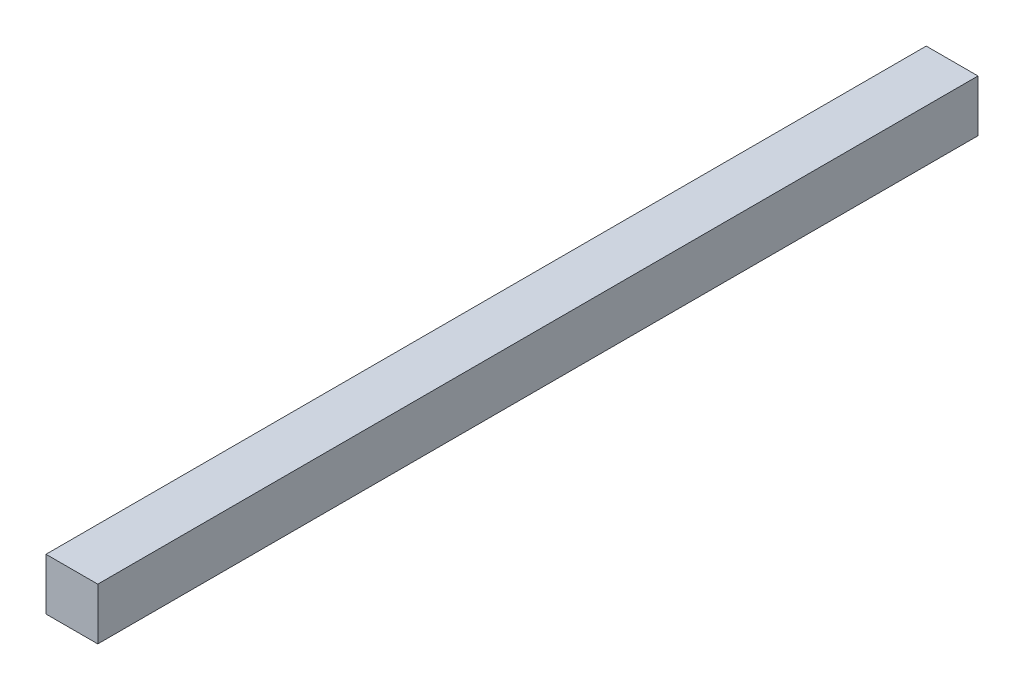
ISO-10303-21;
HEADER;
FILE_DESCRIPTION(('STEP AP214'),'2;1');
FILE_NAME('part.step','',(''),(''),'','','');
FILE_SCHEMA(('AUTOMOTIVE_DESIGN { 1 0 10303 214 1 1 1 1 }'));
ENDSEC;
DATA;
#1=APPLICATION_CONTEXT('core data for automotive mechanical design processes');
#2=APPLICATION_PROTOCOL_DEFINITION('international standard','automotive_design',2000,#1);
#3=PRODUCT_CONTEXT('',#1,'mechanical');
#4=PRODUCT('Part','Part','',(#3));
#5=PRODUCT_RELATED_PRODUCT_CATEGORY('part','',(#4));
#6=PRODUCT_DEFINITION_FORMATION('','',#4);
#7=PRODUCT_DEFINITION_CONTEXT('part definition',#1,'design');
#8=PRODUCT_DEFINITION('design','',#6,#7);
#9=PRODUCT_DEFINITION_SHAPE('','',#8);
#10=(LENGTH_UNIT() NAMED_UNIT(*) SI_UNIT(.MILLI.,.METRE.));
#11=(NAMED_UNIT(*) PLANE_ANGLE_UNIT() SI_UNIT($,.RADIAN.));
#12=(NAMED_UNIT(*) SI_UNIT($,.STERADIAN.) SOLID_ANGLE_UNIT());
#13=UNCERTAINTY_MEASURE_WITH_UNIT(LENGTH_MEASURE(1.E-05),#10,'distance_accuracy_value','');
#14=(GEOMETRIC_REPRESENTATION_CONTEXT(3) GLOBAL_UNCERTAINTY_ASSIGNED_CONTEXT((#13)) GLOBAL_UNIT_ASSIGNED_CONTEXT((#10,
#11,#12)) REPRESENTATION_CONTEXT('',''));
#15=CARTESIAN_POINT('',(0.,0.,0.));
#16=DIRECTION('',(0.,0.,1.));
#17=DIRECTION('',(1.,0.,0.));
#18=AXIS2_PLACEMENT_3D('',#15,#16,#17);
#19=CARTESIAN_POINT('',(0.,0.,431.8));
#20=DIRECTION('',(1.,0.,0.));
#21=DIRECTION('',(0.,0.,-1.));
#22=AXIS2_PLACEMENT_3D('',#19,#20,#21);
#23=PLANE('',#22);
#24=DIRECTION('',(0.,-1.,0.));
#25=VECTOR('',#24,1.);
#26=CARTESIAN_POINT('',(0.,0.,0.));
#27=LINE('',#26,#25);
#28=CARTESIAN_POINT('',(0.,25.4,0.));
#29=VERTEX_POINT('',#28);
#30=CARTESIAN_POINT('',(0.,0.,0.));
#31=VERTEX_POINT('',#30);
#32=EDGE_CURVE('E98',#29,#31,#27,.T.);
#33=ORIENTED_EDGE('',*,*,#32,.T.);
#34=DIRECTION('',(0.,0.,-1.));
#35=VECTOR('',#34,1.);
#36=CARTESIAN_POINT('',(0.,0.,431.8));
#37=LINE('',#36,#35);
#38=CARTESIAN_POINT('',(0.,0.,431.8));
#39=VERTEX_POINT('',#38);
#40=EDGE_CURVE('E11',#39,#31,#37,.T.);
#41=ORIENTED_EDGE('',*,*,#40,.F.);
#42=DIRECTION('',(0.,-1.,0.));
#43=VECTOR('',#42,1.);
#44=CARTESIAN_POINT('',(0.,0.,431.8));
#45=LINE('',#44,#43);
#46=CARTESIAN_POINT('',(0.,25.4,431.8));
#47=VERTEX_POINT('',#46);
#48=EDGE_CURVE('E86',#47,#39,#45,.T.);
#49=ORIENTED_EDGE('',*,*,#48,.F.);
#50=DIRECTION('',(0.,0.,-1.));
#51=VECTOR('',#50,1.);
#52=CARTESIAN_POINT('',(0.,25.4,431.8));
#53=LINE('',#52,#51);
#54=EDGE_CURVE('E94',#47,#29,#53,.T.);
#55=ORIENTED_EDGE('',*,*,#54,.T.);
#56=EDGE_LOOP('',(#33,#41,#49,#55));
#57=FACE_BOUND('',#56,.T.);
#58=ADVANCED_FACE('F35',(#57),#23,.F.);
#59=CARTESIAN_POINT('',(0.,0.,431.8));
#60=DIRECTION('',(0.,1.,0.));
#61=DIRECTION('',(0.,0.,1.));
#62=AXIS2_PLACEMENT_3D('',#59,#60,#61);
#63=PLANE('',#62);
#64=DIRECTION('',(1.,0.,0.));
#65=VECTOR('',#64,1.);
#66=CARTESIAN_POINT('',(0.,0.,0.));
#67=LINE('',#66,#65);
#68=CARTESIAN_POINT('',(25.4,0.,0.));
#69=VERTEX_POINT('',#68);
#70=EDGE_CURVE('E90',#31,#69,#67,.T.);
#71=ORIENTED_EDGE('',*,*,#70,.T.);
#72=DIRECTION('',(0.,0.,-1.));
#73=VECTOR('',#72,1.);
#74=CARTESIAN_POINT('',(25.4,0.,431.8));
#75=LINE('',#74,#73);
#76=CARTESIAN_POINT('',(25.4,0.,431.8));
#77=VERTEX_POINT('',#76);
#78=EDGE_CURVE('E43',#77,#69,#75,.T.);
#79=ORIENTED_EDGE('',*,*,#78,.F.);
#80=DIRECTION('',(1.,0.,0.));
#81=VECTOR('',#80,1.);
#82=CARTESIAN_POINT('',(0.,0.,431.8));
#83=LINE('',#82,#81);
#84=EDGE_CURVE('E81',#39,#77,#83,.T.);
#85=ORIENTED_EDGE('',*,*,#84,.F.);
#86=ORIENTED_EDGE('',*,*,#40,.T.);
#87=EDGE_LOOP('',(#71,#79,#85,#86));
#88=FACE_BOUND('',#87,.T.);
#89=ADVANCED_FACE('F89',(#88),#63,.F.);
#90=CARTESIAN_POINT('',(25.4,0.,431.8));
#91=DIRECTION('',(-1.,0.,0.));
#92=DIRECTION('',(0.,0.,1.));
#93=AXIS2_PLACEMENT_3D('',#90,#91,#92);
#94=PLANE('',#93);
#95=DIRECTION('',(0.,1.,0.));
#96=VECTOR('',#95,1.);
#97=CARTESIAN_POINT('',(25.4,0.,0.));
#98=LINE('',#97,#96);
#99=CARTESIAN_POINT('',(25.4,25.4,0.));
#100=VERTEX_POINT('',#99);
#101=EDGE_CURVE('E68',#69,#100,#98,.T.);
#102=ORIENTED_EDGE('',*,*,#101,.T.);
#103=DIRECTION('',(0.,0.,-1.));
#104=VECTOR('',#103,1.);
#105=CARTESIAN_POINT('',(25.4,25.4,431.8));
#106=LINE('',#105,#104);
#107=CARTESIAN_POINT('',(25.4,25.4,431.8));
#108=VERTEX_POINT('',#107);
#109=EDGE_CURVE('E91',#108,#100,#106,.T.);
#110=ORIENTED_EDGE('',*,*,#109,.F.);
#111=DIRECTION('',(0.,1.,0.));
#112=VECTOR('',#111,1.);
#113=CARTESIAN_POINT('',(25.4,0.,431.8));
#114=LINE('',#113,#112);
#115=EDGE_CURVE('E84',#77,#108,#114,.T.);
#116=ORIENTED_EDGE('',*,*,#115,.F.);
#117=ORIENTED_EDGE('',*,*,#78,.T.);
#118=EDGE_LOOP('',(#102,#110,#116,#117));
#119=FACE_BOUND('',#118,.T.);
#120=ADVANCED_FACE('F92',(#119),#94,.F.);
#121=CARTESIAN_POINT('',(0.,25.4,431.8));
#122=DIRECTION('',(0.,-1.,0.));
#123=DIRECTION('',(0.,0.,-1.));
#124=AXIS2_PLACEMENT_3D('',#121,#122,#123);
#125=PLANE('',#124);
#126=DIRECTION('',(-1.,0.,0.));
#127=VECTOR('',#126,1.);
#128=CARTESIAN_POINT('',(0.,25.4,0.));
#129=LINE('',#128,#127);
#130=EDGE_CURVE('E74',#100,#29,#129,.T.);
#131=ORIENTED_EDGE('',*,*,#130,.T.);
#132=ORIENTED_EDGE('',*,*,#54,.F.);
#133=DIRECTION('',(-1.,0.,0.));
#134=VECTOR('',#133,1.);
#135=CARTESIAN_POINT('',(0.,25.4,431.8));
#136=LINE('',#135,#134);
#137=EDGE_CURVE('E51',#108,#47,#136,.T.);
#138=ORIENTED_EDGE('',*,*,#137,.F.);
#139=ORIENTED_EDGE('',*,*,#109,.T.);
#140=EDGE_LOOP('',(#131,#132,#138,#139));
#141=FACE_BOUND('',#140,.T.);
#142=ADVANCED_FACE('F105',(#141),#125,.F.);
#143=CARTESIAN_POINT('',(0.,0.,431.8));
#144=DIRECTION('',(0.,0.,-1.));
#145=DIRECTION('',(-1.,0.,0.));
#146=AXIS2_PLACEMENT_3D('',#143,#144,#145);
#147=PLANE('',#146);
#148=ORIENTED_EDGE('',*,*,#48,.T.);
#149=ORIENTED_EDGE('',*,*,#84,.T.);
#150=ORIENTED_EDGE('',*,*,#115,.T.);
#151=ORIENTED_EDGE('',*,*,#137,.T.);
#152=EDGE_LOOP('',(#148,#149,#150,#151));
#153=FACE_BOUND('',#152,.T.);
#154=ADVANCED_FACE('F82',(#153),#147,.F.);
#155=CARTESIAN_POINT('',(0.,0.,0.));
#156=DIRECTION('',(0.,0.,-1.));
#157=DIRECTION('',(-1.,0.,0.));
#158=AXIS2_PLACEMENT_3D('',#155,#156,#157);
#159=PLANE('',#158);
#160=ORIENTED_EDGE('',*,*,#32,.F.);
#161=ORIENTED_EDGE('',*,*,#130,.F.);
#162=ORIENTED_EDGE('',*,*,#101,.F.);
#163=ORIENTED_EDGE('',*,*,#70,.F.);
#164=EDGE_LOOP('',(#160,#161,#162,#163));
#165=FACE_BOUND('',#164,.T.);
#166=ADVANCED_FACE('F108',(#165),#159,.T.);
#167=CLOSED_SHELL('',(#58,#89,#120,#142,#154,#166));
#168=MANIFOLD_SOLID_BREP('B2',#167);
#169=ADVANCED_BREP_SHAPE_REPRESENTATION('',(#18,#168),#14);
#170=SHAPE_DEFINITION_REPRESENTATION(#9,#169);
ENDSEC;
END-ISO-10303-21;
